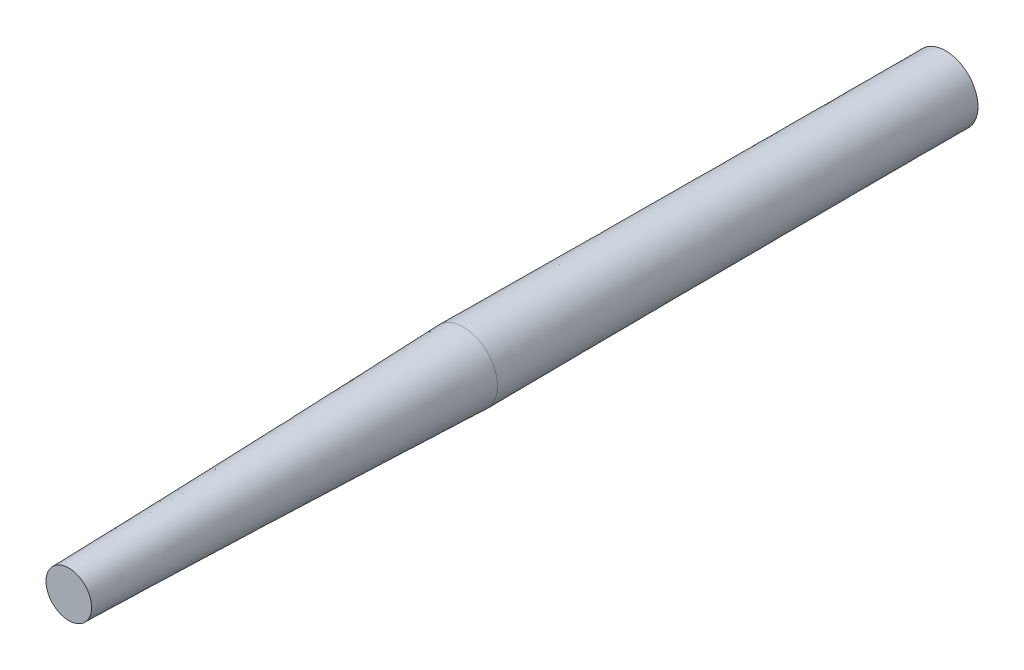
ISO-10303-21;
HEADER;
FILE_DESCRIPTION(('STEP AP214'),'2;1');
FILE_NAME('part.step','',(''),(''),'','','');
FILE_SCHEMA(('AUTOMOTIVE_DESIGN { 1 0 10303 214 1 1 1 1 }'));
ENDSEC;
DATA;
#1=APPLICATION_CONTEXT('core data for automotive mechanical design processes');
#2=APPLICATION_PROTOCOL_DEFINITION('international standard','automotive_design',2000,#1);
#3=PRODUCT_CONTEXT('',#1,'mechanical');
#4=PRODUCT('Part','Part','',(#3));
#5=PRODUCT_RELATED_PRODUCT_CATEGORY('part','',(#4));
#6=PRODUCT_DEFINITION_FORMATION('','',#4);
#7=PRODUCT_DEFINITION_CONTEXT('part definition',#1,'design');
#8=PRODUCT_DEFINITION('design','',#6,#7);
#9=PRODUCT_DEFINITION_SHAPE('','',#8);
#10=(LENGTH_UNIT() NAMED_UNIT(*) SI_UNIT(.MILLI.,.METRE.));
#11=(NAMED_UNIT(*) PLANE_ANGLE_UNIT() SI_UNIT($,.RADIAN.));
#12=(NAMED_UNIT(*) SI_UNIT($,.STERADIAN.) SOLID_ANGLE_UNIT());
#13=UNCERTAINTY_MEASURE_WITH_UNIT(LENGTH_MEASURE(1.E-05),#10,'distance_accuracy_value','');
#14=(GEOMETRIC_REPRESENTATION_CONTEXT(3) GLOBAL_UNCERTAINTY_ASSIGNED_CONTEXT((#13)) GLOBAL_UNIT_ASSIGNED_CONTEXT((#10,
#11,#12)) REPRESENTATION_CONTEXT('',''));
#15=CARTESIAN_POINT('',(0.,0.,0.));
#16=DIRECTION('',(0.,0.,1.));
#17=DIRECTION('',(1.,0.,0.));
#18=AXIS2_PLACEMENT_3D('',#15,#16,#17);
#19=CARTESIAN_POINT('',(0.,0.,0.));
#20=DIRECTION('',(0.,0.,1.));
#21=DIRECTION('',(1.,0.,0.));
#22=AXIS2_PLACEMENT_3D('',#19,#20,#21);
#23=PLANE('',#22);
#24=CARTESIAN_POINT('',(0.,0.,0.));
#25=DIRECTION('',(0.,0.,1.));
#26=DIRECTION('',(1.,0.,0.));
#27=AXIS2_PLACEMENT_3D('',#24,#25,#26);
#28=CIRCLE('',#27,18.5);
#29=CARTESIAN_POINT('',(-16.9037413923731,7.5175479339856,0.));
#30=VERTEX_POINT('',#29);
#31=EDGE_CURVE('E54',#30,#30,#28,.T.);
#32=ORIENTED_EDGE('',*,*,#31,.F.);
#33=EDGE_LOOP('',(#32));
#34=FACE_BOUND('',#33,.T.);
#35=ADVANCED_FACE('F43',(#34),#23,.F.);
#36=CARTESIAN_POINT('',(-16.9037413923731,7.5175479339856,0.));
#37=CARTESIAN_POINT('',(-19.4146075125657,1.82291391267567,275.));
#38=CARTESIAN_POINT('',(-31.9388372603443,-26.2899348507607,0.));
#39=CARTESIAN_POINT('',(-23.0604353379171,-37.0063011124557,275.));
#40=CARTESIAN_POINT('',(1.86864552440194,-41.3250307187319,0.));
#41=CARTESIAN_POINT('',(15.7687796872144,-40.6521289378071,275.));
#42=CARTESIAN_POINT('',(16.9037413923731,-7.5175479339856,0.));
#43=CARTESIAN_POINT('',(19.4146075125657,-1.82291391267568,275.));
#44=CARTESIAN_POINT('',(31.9388372603443,26.2899348507607,0.));
#45=CARTESIAN_POINT('',(23.0604353379171,37.0063011124558,275.));
#46=CARTESIAN_POINT('',(-1.86864552440194,41.3250307187319,0.));
#47=CARTESIAN_POINT('',(-15.7687796872144,40.6521289378071,275.));
#48=CARTESIAN_POINT('',(-16.9037413923731,7.5175479339856,0.));
#49=CARTESIAN_POINT('',(-19.4146075125657,1.82291391267567,275.));
#50=(BOUNDED_SURFACE() B_SPLINE_SURFACE(3,1,((#36,#37),(#38,#39),(#40,#41),(#42,#43),(#44,#45),
(#46,#47),(#48,#49)),.UNSPECIFIED.,.T.,.F.,.F.) B_SPLINE_SURFACE_WITH_KNOTS((4,3,4),(2,2),(0.,
0.5,1.),(0.,1.),.UNSPECIFIED.) GEOMETRIC_REPRESENTATION_ITEM() RATIONAL_B_SPLINE_SURFACE(((1.,
1.),(0.333333333333333,0.333333333333334),(0.333333333333333,0.333333333333334),(1.,1.),
(0.333333333333333,0.333333333333333),(0.333333333333333,0.333333333333333),(1.,1.))) REPRESENTATION_ITEM('') SURFACE());
#51=CARTESIAN_POINT('',(0.,0.,275.));
#52=DIRECTION('',(0.,0.,1.));
#53=DIRECTION('',(1.,0.,0.));
#54=AXIS2_PLACEMENT_3D('',#51,#52,#53);
#55=CIRCLE('',#54,19.5);
#56=CARTESIAN_POINT('',(-19.4146075125657,1.82291391267567,275.));
#57=VERTEX_POINT('',#56);
#58=EDGE_CURVE('E11',#57,#57,#55,.T.);
#59=CARTESIAN_POINT('',(-16.9037413923731,7.5175479339856,0.));
#60=CARTESIAN_POINT('',(-16.9298962477918,7.45822882959695,2.86458333333333));
#61=CARTESIAN_POINT('',(-16.9560511032105,7.39890972520831,5.72916666666666));
#62=CARTESIAN_POINT('',(-17.0083608140478,7.28027151643102,11.4583333333333));
#63=CARTESIAN_POINT('',(-17.0345156694665,7.22095241204237,14.3229166666667));
#64=CARTESIAN_POINT('',(-17.0868253803038,7.10231420326508,20.0520833333333));
#65=CARTESIAN_POINT('',(-17.1129802357225,7.04299509887644,22.9166666666667));
#66=CARTESIAN_POINT('',(-17.1652899465599,6.92435689009915,28.6458333333333));
#67=CARTESIAN_POINT('',(-17.1914448019785,6.8650377857105,31.5104166666667));
#68=CARTESIAN_POINT('',(-17.2437545128159,6.74639957693321,37.2395833333333));
#69=CARTESIAN_POINT('',(-17.2699093682346,6.68708047254457,40.1041666666667));
#70=CARTESIAN_POINT('',(-17.3222190790719,6.56844226376728,45.8333333333333));
#71=CARTESIAN_POINT('',(-17.3483739344906,6.50912315937863,48.6979166666667));
#72=CARTESIAN_POINT('',(-17.4006836453279,6.39048495060134,54.4270833333333));
#73=CARTESIAN_POINT('',(-17.4268385007466,6.3311658462127,57.2916666666667));
#74=CARTESIAN_POINT('',(-17.4791482115839,6.21252763743541,63.0208333333333));
#75=CARTESIAN_POINT('',(-17.5053030670026,6.15320853304676,65.8854166666667));
#76=CARTESIAN_POINT('',(-17.55761277784,6.03457032426947,71.6145833333333));
#77=CARTESIAN_POINT('',(-17.5837676332586,5.97525121988083,74.4791666666667));
#78=CARTESIAN_POINT('',(-17.636077344096,5.85661301110354,80.2083333333333));
#79=CARTESIAN_POINT('',(-17.6622321995146,5.79729390671489,83.0729166666667));
#80=CARTESIAN_POINT('',(-17.714541910352,5.6786556979376,88.8020833333333));
#81=CARTESIAN_POINT('',(-17.7406967657707,5.61933659354896,91.6666666666667));
#82=CARTESIAN_POINT('',(-17.793006476608,5.50069838477167,97.3958333333333));
#83=CARTESIAN_POINT('',(-17.8191613320267,5.44137928038302,100.260416666667));
#84=CARTESIAN_POINT('',(-17.871471042864,5.32274107160573,105.989583333333));
#85=CARTESIAN_POINT('',(-17.8976258982827,5.26342196721709,108.854166666667));
#86=CARTESIAN_POINT('',(-17.94993560912,5.1447837584398,114.583333333333));
#87=CARTESIAN_POINT('',(-17.9760904645387,5.08546465405115,117.447916666667));
#88=CARTESIAN_POINT('',(-18.0284001753761,4.96682644527386,123.177083333333));
#89=CARTESIAN_POINT('',(-18.0545550307947,4.90750734088521,126.041666666667));
#90=CARTESIAN_POINT('',(-18.1068647416321,4.78886913210792,131.770833333333));
#91=CARTESIAN_POINT('',(-18.1330195970508,4.72955002771928,134.635416666667));
#92=CARTESIAN_POINT('',(-18.1853293078881,4.61091181894199,140.364583333333));
#93=CARTESIAN_POINT('',(-18.2114841633068,4.55159271455334,143.229166666667));
#94=CARTESIAN_POINT('',(-18.2637938741441,4.43295450577605,148.958333333333));
#95=CARTESIAN_POINT('',(-18.2899487295628,4.37363540138741,151.822916666667));
#96=CARTESIAN_POINT('',(-18.3422584404001,4.25499719261012,157.552083333333));
#97=CARTESIAN_POINT('',(-18.3684132958188,4.19567808822147,160.416666666667));
#98=CARTESIAN_POINT('',(-18.4207230066562,4.07703987944418,166.145833333333));
#99=CARTESIAN_POINT('',(-18.4468778620748,4.01772077505554,169.010416666667));
#100=CARTESIAN_POINT('',(-18.4991875729122,3.89908256627825,174.739583333333));
#101=CARTESIAN_POINT('',(-18.5253424283308,3.8397634618896,177.604166666667));
#102=CARTESIAN_POINT('',(-18.5776521391682,3.72112525311231,183.333333333333));
#103=CARTESIAN_POINT('',(-18.6038069945869,3.66180614872367,186.197916666667));
#104=CARTESIAN_POINT('',(-18.6561167054242,3.54316793994638,191.927083333333));
#105=CARTESIAN_POINT('',(-18.6822715608429,3.48384883555773,194.791666666667));
#106=CARTESIAN_POINT('',(-18.7345812716802,3.36521062678044,200.520833333333));
#107=CARTESIAN_POINT('',(-18.7607361270989,3.3058915223918,203.385416666667));
#108=CARTESIAN_POINT('',(-18.8130458379362,3.18725331361451,209.114583333333));
#109=CARTESIAN_POINT('',(-18.8392006933549,3.12793420922586,211.979166666667));
#110=CARTESIAN_POINT('',(-18.8915104041923,3.00929600044857,217.708333333333));
#111=CARTESIAN_POINT('',(-18.9176652596109,2.94997689605993,220.572916666667));
#112=CARTESIAN_POINT('',(-18.9699749704483,2.83133868728264,226.302083333333));
#113=CARTESIAN_POINT('',(-18.996129825867,2.77201958289399,229.166666666667));
#114=CARTESIAN_POINT('',(-19.0484395367043,2.6533813741167,234.895833333333));
#115=CARTESIAN_POINT('',(-19.074594392123,2.59406226972806,237.760416666667));
#116=CARTESIAN_POINT('',(-19.1269041029603,2.47542406095077,243.489583333333));
#117=CARTESIAN_POINT('',(-19.153058958379,2.41610495656212,246.354166666667));
#118=CARTESIAN_POINT('',(-19.2053686692163,2.29746674778483,252.083333333333));
#119=CARTESIAN_POINT('',(-19.231523524635,2.23814764339619,254.947916666667));
#120=CARTESIAN_POINT('',(-19.2838332354724,2.1195094346189,260.677083333333));
#121=CARTESIAN_POINT('',(-19.309988090891,2.06019033023025,263.541666666667));
#122=CARTESIAN_POINT('',(-19.3622978017284,1.94155212145296,269.270833333333));
#123=CARTESIAN_POINT('',(-19.3884526571471,1.88223301706432,272.135416666667));
#124=CARTESIAN_POINT('',(-19.4146075125657,1.82291391267567,275.));
#125=B_SPLINE_CURVE_WITH_KNOTS('',3,(#59,#60,#61,#62,#63,#64,#65,#66,#67,#68,#69,#70,#71,#72,
#73,#74,#75,#76,#77,#78,#79,#80,#81,#82,#83,#84,#85,#86,#87,#88,#89,#90,#91,#92,#93,#94,#95,#96,
#97,#98,#99,#100,#101,#102,#103,#104,#105,#106,#107,#108,#109,#110,#111,#112,#113,#114,#115,
#116,#117,#118,#119,#120,#121,#122,#123,#124),.UNSPECIFIED.,.F.,.F.,(4,2,2,2,2,2,2,2,2,2,2,2,2,
2,2,2,2,2,2,2,2,2,2,2,2,2,2,2,2,2,2,2,4),(0.,8.59595047426211,17.1919009485242,25.7878514227863,
34.3838018970484,42.9797523713105,51.5757028455727,60.1716533198348,68.7676037940969,
77.363554268359,85.9595047426211,94.5554552168832,103.151405691145,111.747356165407,
120.34330663967,128.939257113932,137.535207588194,146.131158062456,154.727108536718,
163.32305901098,171.919009485242,180.514959959504,189.110910433766,197.706860908029,
206.302811382291,214.898761856553,223.494712330815,232.090662805077,240.686613279339,
249.282563753601,257.878514227863,266.474464702125,275.070415176388),.UNSPECIFIED.);
#126=EDGE_CURVE('BSEAM45',#30,#57,#125,.T.);
#127=ORIENTED_EDGE('',*,*,#31,.T.);
#128=ORIENTED_EDGE('',*,*,#58,.F.);
#129=ORIENTED_EDGE('',*,*,#126,.T.);
#130=ORIENTED_EDGE('',*,*,#126,.F.);
#131=EDGE_LOOP('',(#127,#129,#128,#130));
#132=FACE_BOUND('',#131,.T.);
#133=ADVANCED_FACE('F45',(#132),#50,.T.);
#134=CARTESIAN_POINT('',(0.,0.,500.));
#135=DIRECTION('',(0.,0.,1.));
#136=DIRECTION('',(1.,0.,0.));
#137=AXIS2_PLACEMENT_3D('',#134,#135,#136);
#138=PLANE('',#137);
#139=CARTESIAN_POINT('',(0.,0.,500.));
#140=DIRECTION('',(0.,0.,1.));
#141=DIRECTION('',(1.,0.,0.));
#142=AXIS2_PLACEMENT_3D('',#139,#140,#141);
#143=CIRCLE('',#142,13.);
#144=CARTESIAN_POINT('',(13.,0.,500.));
#145=VERTEX_POINT('',#144);
#146=EDGE_CURVE('E59',#145,#145,#143,.T.);
#147=ORIENTED_EDGE('',*,*,#146,.T.);
#148=EDGE_LOOP('',(#147));
#149=FACE_BOUND('',#148,.T.);
#150=ADVANCED_FACE('F88',(#149),#138,.T.);
#151=CARTESIAN_POINT('',(-19.487052906775,0.710470976573258,275.));
#152=CARTESIAN_POINT('',(-11.5830848144488,5.9018764966141,500.));
#153=CARTESIAN_POINT('',(-20.9079948599215,-38.2636348369767,275.));
#154=CARTESIAN_POINT('',(-23.386837807677,-17.2642931322835,500.));
#155=CARTESIAN_POINT('',(18.0661109536285,-39.6845767901232,275.));
#156=CARTESIAN_POINT('',(-0.22066817877942,-29.0680461255117,500.));
#157=CARTESIAN_POINT('',(19.487052906775,-0.710470976573243,275.));
#158=CARTESIAN_POINT('',(11.5830848144488,-5.9018764966141,500.));
#159=CARTESIAN_POINT('',(20.9079948599215,38.2636348369767,275.));
#160=CARTESIAN_POINT('',(23.386837807677,17.2642931322835,500.));
#161=CARTESIAN_POINT('',(-18.0661109536285,39.6845767901232,275.));
#162=CARTESIAN_POINT('',(0.22066817877941,29.0680461255117,500.));
#163=CARTESIAN_POINT('',(-19.487052906775,0.710470976573258,275.));
#164=CARTESIAN_POINT('',(-11.5830848144488,5.9018764966141,500.));
#165=(BOUNDED_SURFACE() B_SPLINE_SURFACE(3,1,((#151,#152),(#153,#154),(#155,#156),(#157,#158),
(#159,#160),(#161,#162),(#163,#164)),.UNSPECIFIED.,.T.,.F.,.F.) B_SPLINE_SURFACE_WITH_KNOTS((4,
3,4),(2,2),(0.,0.5,1.),(0.,1.),
.UNSPECIFIED.) GEOMETRIC_REPRESENTATION_ITEM() RATIONAL_B_SPLINE_SURFACE(((1.,1.),
(0.333333333333333,0.333333333333333),(0.333333333333333,0.333333333333333),(1.,1.),
(0.333333333333333,0.333333333333333),(0.333333333333333,0.333333333333333),(1.,1.))) REPRESENTATION_ITEM('') SURFACE());
#166=ORIENTED_EDGE('',*,*,#58,.T.);
#167=EDGE_LOOP('',(#166));
#168=FACE_BOUND('',#167,.T.);
#169=ORIENTED_EDGE('',*,*,#146,.F.);
#170=EDGE_LOOP('',(#169));
#171=FACE_BOUND('',#170,.T.);
#172=ADVANCED_FACE('F82',(#168,#171),#165,.T.);
#173=CLOSED_SHELL('',(#35,#133,#150,#172));
#174=MANIFOLD_SOLID_BREP('B2',#173);
#175=ADVANCED_BREP_SHAPE_REPRESENTATION('',(#18,#174),#14);
#176=SHAPE_DEFINITION_REPRESENTATION(#9,#175);
ENDSEC;
END-ISO-10303-21;
